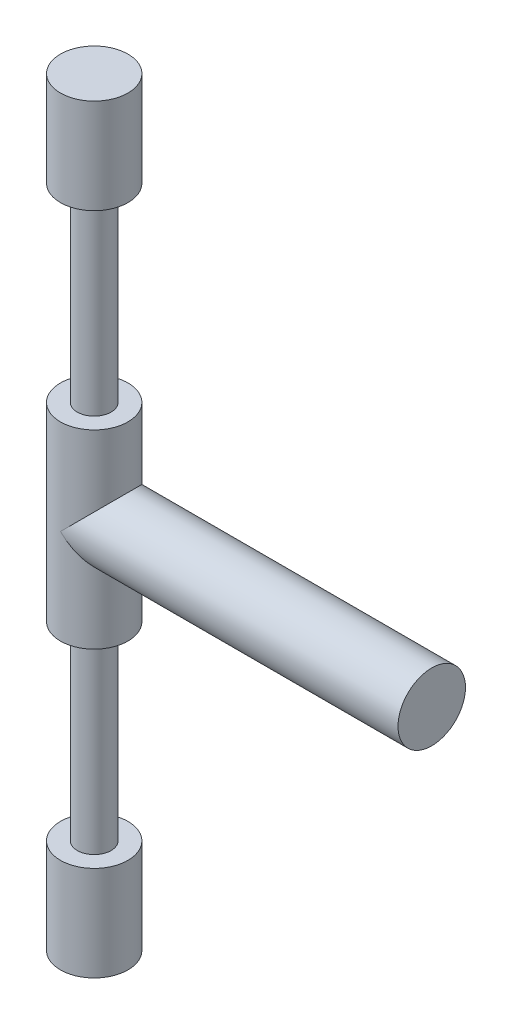
ISO-10303-21;
HEADER;
FILE_DESCRIPTION(('STEP AP214'),'2;1');
FILE_NAME('part.step','',(''),(''),'','','');
FILE_SCHEMA(('AUTOMOTIVE_DESIGN { 1 0 10303 214 1 1 1 1 }'));
ENDSEC;
DATA;
#1=APPLICATION_CONTEXT('core data for automotive mechanical design processes');
#2=APPLICATION_PROTOCOL_DEFINITION('international standard','automotive_design',2000,#1);
#3=PRODUCT_CONTEXT('',#1,'mechanical');
#4=PRODUCT('Part','Part','',(#3));
#5=PRODUCT_RELATED_PRODUCT_CATEGORY('part','',(#4));
#6=PRODUCT_DEFINITION_FORMATION('','',#4);
#7=PRODUCT_DEFINITION_CONTEXT('part definition',#1,'design');
#8=PRODUCT_DEFINITION('design','',#6,#7);
#9=PRODUCT_DEFINITION_SHAPE('','',#8);
#10=(LENGTH_UNIT() NAMED_UNIT(*) SI_UNIT(.MILLI.,.METRE.));
#11=(NAMED_UNIT(*) PLANE_ANGLE_UNIT() SI_UNIT($,.RADIAN.));
#12=(NAMED_UNIT(*) SI_UNIT($,.STERADIAN.) SOLID_ANGLE_UNIT());
#13=UNCERTAINTY_MEASURE_WITH_UNIT(LENGTH_MEASURE(1.E-05),#10,'distance_accuracy_value','');
#14=(GEOMETRIC_REPRESENTATION_CONTEXT(3) GLOBAL_UNCERTAINTY_ASSIGNED_CONTEXT((#13)) GLOBAL_UNIT_ASSIGNED_CONTEXT((#10,
#11,#12)) REPRESENTATION_CONTEXT('',''));
#15=CARTESIAN_POINT('',(0.,0.,0.));
#16=DIRECTION('',(0.,0.,1.));
#17=DIRECTION('',(1.,0.,0.));
#18=AXIS2_PLACEMENT_3D('',#15,#16,#17);
#19=CARTESIAN_POINT('',(-10.,-11.25,0.));
#20=DIRECTION('',(0.,1.,0.));
#21=DIRECTION('',(0.,0.,1.));
#22=AXIS2_PLACEMENT_3D('',#19,#20,#21);
#23=CYLINDRICAL_SURFACE('',#22,0.500000000000001);
#24=CARTESIAN_POINT('',(-10.,-2.8125,0.));
#25=DIRECTION('',(0.,1.,0.));
#26=DIRECTION('',(0.,0.,1.));
#27=AXIS2_PLACEMENT_3D('',#24,#25,#26);
#28=CIRCLE('',#27,0.500000000000001);
#29=CARTESIAN_POINT('',(-10.,-2.8125,0.500000000000001));
#30=VERTEX_POINT('',#29);
#31=EDGE_CURVE('E64',#30,#30,#28,.F.);
#32=ORIENTED_EDGE('',*,*,#31,.T.);
#33=EDGE_LOOP('',(#32));
#34=FACE_BOUND('',#33,.T.);
#35=CARTESIAN_POINT('',(-10.,-8.4375,0.));
#36=DIRECTION('',(0.,-1.,0.));
#37=DIRECTION('',(0.,0.,-1.));
#38=AXIS2_PLACEMENT_3D('',#35,#36,#37);
#39=CIRCLE('',#38,0.500000000000001);
#40=CARTESIAN_POINT('',(-10.,-8.4375,-0.500000000000001));
#41=VERTEX_POINT('',#40);
#42=EDGE_CURVE('E44',#41,#41,#39,.F.);
#43=ORIENTED_EDGE('',*,*,#42,.T.);
#44=EDGE_LOOP('',(#43));
#45=FACE_BOUND('',#44,.T.);
#46=ADVANCED_FACE('F40',(#34,#45),#23,.T.);
#47=CARTESIAN_POINT('',(-10.,2.8125,0.));
#48=DIRECTION('',(0.,1.,0.));
#49=DIRECTION('',(0.,0.,1.));
#50=AXIS2_PLACEMENT_3D('',#47,#48,#49);
#51=CIRCLE('',#50,0.500000000000001);
#52=CARTESIAN_POINT('',(-10.,2.8125,0.500000000000001));
#53=VERTEX_POINT('',#52);
#54=EDGE_CURVE('E11',#53,#53,#51,.F.);
#55=ORIENTED_EDGE('',*,*,#54,.F.);
#56=EDGE_LOOP('',(#55));
#57=FACE_BOUND('',#56,.T.);
#58=CARTESIAN_POINT('',(-10.,8.4375,0.));
#59=DIRECTION('',(0.,1.,0.));
#60=DIRECTION('',(0.,0.,1.));
#61=AXIS2_PLACEMENT_3D('',#58,#59,#60);
#62=CIRCLE('',#61,0.500000000000001);
#63=CARTESIAN_POINT('',(-10.,8.4375,0.500000000000001));
#64=VERTEX_POINT('',#63);
#65=EDGE_CURVE('E73',#64,#64,#62,.F.);
#66=ORIENTED_EDGE('',*,*,#65,.T.);
#67=EDGE_LOOP('',(#66));
#68=FACE_BOUND('',#67,.T.);
#69=ADVANCED_FACE('F114',(#57,#68),#23,.T.);
#70=CARTESIAN_POINT('',(-10.,0.,0.));
#71=DIRECTION('',(1.,0.,0.));
#72=DIRECTION('',(0.,0.,-1.));
#73=AXIS2_PLACEMENT_3D('',#70,#71,#72);
#74=CYLINDRICAL_SURFACE('',#73,1.);
#75=CARTESIAN_POINT('',(-10.,0.,0.));
#76=DIRECTION('',(0.707106781186548,0.707106781186547,0.));
#77=DIRECTION('',(0.707106781186548,-0.707106781186547,0.));
#78=AXIS2_PLACEMENT_3D('',#75,#76,#77);
#79=ELLIPSE('',#78,1.41421356237309,1.);
#80=CARTESIAN_POINT('',(-10.,0.,-1.));
#81=VERTEX_POINT('',#80);
#82=CARTESIAN_POINT('',(-10.,0.,0.999999999999999));
#83=VERTEX_POINT('',#82);
#84=EDGE_CURVE('E58',#81,#83,#79,.F.);
#85=ORIENTED_EDGE('',*,*,#84,.F.);
#86=CARTESIAN_POINT('',(-10.,0.,0.));
#87=DIRECTION('',(0.707106781186548,-0.707106781186547,0.));
#88=DIRECTION('',(0.707106781186548,0.707106781186547,0.));
#89=AXIS2_PLACEMENT_3D('',#86,#87,#88);
#90=ELLIPSE('',#89,1.41421356237309,1.);
#91=EDGE_CURVE('E56',#83,#81,#90,.F.);
#92=ORIENTED_EDGE('',*,*,#91,.F.);
#93=EDGE_LOOP('',(#85,#92));
#94=FACE_BOUND('',#93,.T.);
#95=CARTESIAN_POINT('',(0.,0.,0.));
#96=DIRECTION('',(1.,0.,0.));
#97=DIRECTION('',(0.,0.,-1.));
#98=AXIS2_PLACEMENT_3D('',#95,#96,#97);
#99=CIRCLE('',#98,1.);
#100=CARTESIAN_POINT('',(0.,0.,-1.));
#101=VERTEX_POINT('',#100);
#102=EDGE_CURVE('E49',#101,#101,#99,.T.);
#103=ORIENTED_EDGE('',*,*,#102,.F.);
#104=EDGE_LOOP('',(#103));
#105=FACE_BOUND('',#104,.T.);
#106=ADVANCED_FACE('F42',(#94,#105),#74,.T.);
#107=CARTESIAN_POINT('',(0.,0.,0.));
#108=DIRECTION('',(1.,0.,0.));
#109=DIRECTION('',(0.,0.,-1.));
#110=AXIS2_PLACEMENT_3D('',#107,#108,#109);
#111=PLANE('',#110);
#112=ORIENTED_EDGE('',*,*,#102,.T.);
#113=EDGE_LOOP('',(#112));
#114=FACE_BOUND('',#113,.T.);
#115=ADVANCED_FACE('F122',(#114),#111,.T.);
#116=CARTESIAN_POINT('',(-10.,-2.8125,0.));
#117=DIRECTION('',(0.,1.,0.));
#118=DIRECTION('',(0.,0.,1.));
#119=AXIS2_PLACEMENT_3D('',#116,#117,#118);
#120=CYLINDRICAL_SURFACE('',#119,1.);
#121=ORIENTED_EDGE('',*,*,#91,.T.);
#122=ORIENTED_EDGE('',*,*,#84,.T.);
#123=EDGE_LOOP('',(#121,#122));
#124=FACE_BOUND('',#123,.T.);
#125=CARTESIAN_POINT('',(-10.,-2.8125,0.));
#126=DIRECTION('',(0.,1.,0.));
#127=DIRECTION('',(0.,0.,1.));
#128=AXIS2_PLACEMENT_3D('',#125,#126,#127);
#129=CIRCLE('',#128,1.);
#130=CARTESIAN_POINT('',(-10.,-2.8125,1.));
#131=VERTEX_POINT('',#130);
#132=EDGE_CURVE('E67',#131,#131,#129,.T.);
#133=ORIENTED_EDGE('',*,*,#132,.T.);
#134=EDGE_LOOP('',(#133));
#135=FACE_BOUND('',#134,.T.);
#136=CARTESIAN_POINT('',(-10.,2.8125,0.));
#137=DIRECTION('',(0.,1.,0.));
#138=DIRECTION('',(0.,0.,1.));
#139=AXIS2_PLACEMENT_3D('',#136,#137,#138);
#140=CIRCLE('',#139,1.);
#141=CARTESIAN_POINT('',(-10.,2.8125,1.));
#142=VERTEX_POINT('',#141);
#143=EDGE_CURVE('E75',#142,#142,#140,.T.);
#144=ORIENTED_EDGE('',*,*,#143,.F.);
#145=EDGE_LOOP('',(#144));
#146=FACE_BOUND('',#145,.T.);
#147=ADVANCED_FACE('F62',(#124,#135,#146),#120,.T.);
#148=CARTESIAN_POINT('',(-10.,-2.8125,0.));
#149=DIRECTION('',(0.,1.,0.));
#150=DIRECTION('',(0.,0.,1.));
#151=AXIS2_PLACEMENT_3D('',#148,#149,#150);
#152=PLANE('',#151);
#153=ORIENTED_EDGE('',*,*,#31,.F.);
#154=EDGE_LOOP('',(#153));
#155=FACE_BOUND('',#154,.T.);
#156=ORIENTED_EDGE('',*,*,#132,.F.);
#157=EDGE_LOOP('',(#156));
#158=FACE_BOUND('',#157,.T.);
#159=ADVANCED_FACE('F129',(#155,#158),#152,.F.);
#160=CARTESIAN_POINT('',(-10.,2.8125,0.));
#161=DIRECTION('',(0.,1.,0.));
#162=DIRECTION('',(0.,0.,1.));
#163=AXIS2_PLACEMENT_3D('',#160,#161,#162);
#164=PLANE('',#163);
#165=ORIENTED_EDGE('',*,*,#54,.T.);
#166=EDGE_LOOP('',(#165));
#167=FACE_BOUND('',#166,.T.);
#168=ORIENTED_EDGE('',*,*,#143,.T.);
#169=EDGE_LOOP('',(#168));
#170=FACE_BOUND('',#169,.T.);
#171=ADVANCED_FACE('F147',(#167,#170),#164,.T.);
#172=CARTESIAN_POINT('',(-10.,8.4375,0.));
#173=DIRECTION('',(0.,1.,0.));
#174=DIRECTION('',(0.,0.,1.));
#175=AXIS2_PLACEMENT_3D('',#172,#173,#174);
#176=CYLINDRICAL_SURFACE('',#175,1.);
#177=CARTESIAN_POINT('',(-10.,8.4375,0.));
#178=DIRECTION('',(0.,1.,0.));
#179=DIRECTION('',(0.,0.,1.));
#180=AXIS2_PLACEMENT_3D('',#177,#178,#179);
#181=CIRCLE('',#180,1.);
#182=CARTESIAN_POINT('',(-10.,8.4375,1.));
#183=VERTEX_POINT('',#182);
#184=EDGE_CURVE('E76',#183,#183,#181,.T.);
#185=ORIENTED_EDGE('',*,*,#184,.T.);
#186=EDGE_LOOP('',(#185));
#187=FACE_BOUND('',#186,.T.);
#188=CARTESIAN_POINT('',(-10.,11.25,0.));
#189=DIRECTION('',(0.,1.,0.));
#190=DIRECTION('',(0.,0.,1.));
#191=AXIS2_PLACEMENT_3D('',#188,#189,#190);
#192=CIRCLE('',#191,1.);
#193=CARTESIAN_POINT('',(-10.,11.25,1.));
#194=VERTEX_POINT('',#193);
#195=EDGE_CURVE('E81',#194,#194,#192,.T.);
#196=ORIENTED_EDGE('',*,*,#195,.F.);
#197=EDGE_LOOP('',(#196));
#198=FACE_BOUND('',#197,.T.);
#199=ADVANCED_FACE('F151',(#187,#198),#176,.T.);
#200=CARTESIAN_POINT('',(-10.,8.4375,0.));
#201=DIRECTION('',(0.,1.,0.));
#202=DIRECTION('',(0.,0.,1.));
#203=AXIS2_PLACEMENT_3D('',#200,#201,#202);
#204=PLANE('',#203);
#205=ORIENTED_EDGE('',*,*,#65,.F.);
#206=EDGE_LOOP('',(#205));
#207=FACE_BOUND('',#206,.T.);
#208=ORIENTED_EDGE('',*,*,#184,.F.);
#209=EDGE_LOOP('',(#208));
#210=FACE_BOUND('',#209,.T.);
#211=ADVANCED_FACE('F155',(#207,#210),#204,.F.);
#212=CARTESIAN_POINT('',(0.,11.25,0.));
#213=DIRECTION('',(0.,1.,0.));
#214=DIRECTION('',(0.,0.,1.));
#215=AXIS2_PLACEMENT_3D('',#212,#213,#214);
#216=PLANE('',#215);
#217=ORIENTED_EDGE('',*,*,#195,.T.);
#218=EDGE_LOOP('',(#217));
#219=FACE_BOUND('',#218,.T.);
#220=ADVANCED_FACE('F110',(#219),#216,.T.);
#221=CARTESIAN_POINT('',(-10.,-8.4375,0.));
#222=DIRECTION('',(0.,-1.,0.));
#223=DIRECTION('',(0.,0.,-1.));
#224=AXIS2_PLACEMENT_3D('',#221,#222,#223);
#225=CYLINDRICAL_SURFACE('',#224,1.);
#226=CARTESIAN_POINT('',(-10.,-8.4375,0.));
#227=DIRECTION('',(0.,1.,0.));
#228=DIRECTION('',(0.,0.,1.));
#229=AXIS2_PLACEMENT_3D('',#226,#227,#228);
#230=CIRCLE('',#229,1.);
#231=CARTESIAN_POINT('',(-10.,-8.4375,1.));
#232=VERTEX_POINT('',#231);
#233=EDGE_CURVE('E91',#232,#232,#230,.T.);
#234=ORIENTED_EDGE('',*,*,#233,.F.);
#235=EDGE_LOOP('',(#234));
#236=FACE_BOUND('',#235,.T.);
#237=CARTESIAN_POINT('',(-10.,-11.25,0.));
#238=DIRECTION('',(0.,1.,0.));
#239=DIRECTION('',(0.,0.,1.));
#240=AXIS2_PLACEMENT_3D('',#237,#238,#239);
#241=CIRCLE('',#240,1.);
#242=CARTESIAN_POINT('',(-10.,-11.25,1.));
#243=VERTEX_POINT('',#242);
#244=EDGE_CURVE('E88',#243,#243,#241,.T.);
#245=ORIENTED_EDGE('',*,*,#244,.T.);
#246=EDGE_LOOP('',(#245));
#247=FACE_BOUND('',#246,.T.);
#248=ADVANCED_FACE('F102',(#236,#247),#225,.T.);
#249=CARTESIAN_POINT('',(-10.,-8.4375,0.));
#250=DIRECTION('',(0.,-1.,0.));
#251=DIRECTION('',(0.,0.,1.));
#252=AXIS2_PLACEMENT_3D('',#249,#250,#251);
#253=PLANE('',#252);
#254=ORIENTED_EDGE('',*,*,#42,.F.);
#255=EDGE_LOOP('',(#254));
#256=FACE_BOUND('',#255,.T.);
#257=ORIENTED_EDGE('',*,*,#233,.T.);
#258=EDGE_LOOP('',(#257));
#259=FACE_BOUND('',#258,.T.);
#260=ADVANCED_FACE('F99',(#256,#259),#253,.F.);
#261=CARTESIAN_POINT('',(0.,-11.25,0.));
#262=DIRECTION('',(0.,1.,0.));
#263=DIRECTION('',(0.,0.,1.));
#264=AXIS2_PLACEMENT_3D('',#261,#262,#263);
#265=PLANE('',#264);
#266=ORIENTED_EDGE('',*,*,#244,.F.);
#267=EDGE_LOOP('',(#266));
#268=FACE_BOUND('',#267,.T.);
#269=ADVANCED_FACE('F101',(#268),#265,.F.);
#270=CLOSED_SHELL('',(#46,#69,#106,#115,#147,#159,#171,#199,#211,#220,#248,#260,#269));
#271=MANIFOLD_SOLID_BREP('B2',#270);
#272=ADVANCED_BREP_SHAPE_REPRESENTATION('',(#18,#271),#14);
#273=SHAPE_DEFINITION_REPRESENTATION(#9,#272);
ENDSEC;
END-ISO-10303-21;
